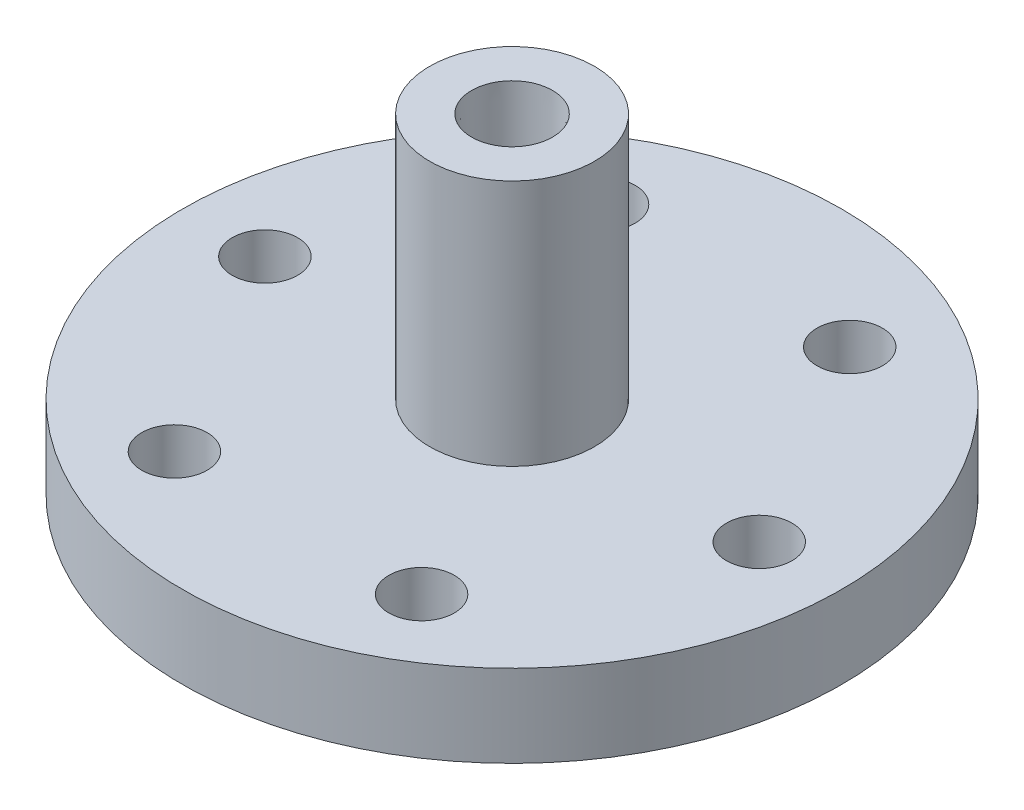
ISO-10303-21;
HEADER;
FILE_DESCRIPTION(('STEP AP214'),'2;1');
FILE_NAME('part.step','',(''),(''),'','','');
FILE_SCHEMA(('AUTOMOTIVE_DESIGN { 1 0 10303 214 1 1 1 1 }'));
ENDSEC;
DATA;
#1=APPLICATION_CONTEXT('core data for automotive mechanical design processes');
#2=APPLICATION_PROTOCOL_DEFINITION('international standard','automotive_design',2000,#1);
#3=PRODUCT_CONTEXT('',#1,'mechanical');
#4=PRODUCT('Part','Part','',(#3));
#5=PRODUCT_RELATED_PRODUCT_CATEGORY('part','',(#4));
#6=PRODUCT_DEFINITION_FORMATION('','',#4);
#7=PRODUCT_DEFINITION_CONTEXT('part definition',#1,'design');
#8=PRODUCT_DEFINITION('design','',#6,#7);
#9=PRODUCT_DEFINITION_SHAPE('','',#8);
#10=(LENGTH_UNIT() NAMED_UNIT(*) SI_UNIT(.MILLI.,.METRE.));
#11=(NAMED_UNIT(*) PLANE_ANGLE_UNIT() SI_UNIT($,.RADIAN.));
#12=(NAMED_UNIT(*) SI_UNIT($,.STERADIAN.) SOLID_ANGLE_UNIT());
#13=UNCERTAINTY_MEASURE_WITH_UNIT(LENGTH_MEASURE(1.E-05),#10,'distance_accuracy_value','');
#14=(GEOMETRIC_REPRESENTATION_CONTEXT(3) GLOBAL_UNCERTAINTY_ASSIGNED_CONTEXT((#13)) GLOBAL_UNIT_ASSIGNED_CONTEXT((#10,
#11,#12)) REPRESENTATION_CONTEXT('',''));
#15=CARTESIAN_POINT('',(0.,0.,0.));
#16=DIRECTION('',(0.,0.,1.));
#17=DIRECTION('',(1.,0.,0.));
#18=AXIS2_PLACEMENT_3D('',#15,#16,#17);
#19=CARTESIAN_POINT('',(0.,0.,0.));
#20=DIRECTION('',(0.,-1.,0.));
#21=DIRECTION('',(0.,0.,-1.));
#22=AXIS2_PLACEMENT_3D('',#19,#20,#21);
#23=PLANE('',#22);
#24=CARTESIAN_POINT('',(0.,0.,0.));
#25=DIRECTION('',(0.,1.,0.));
#26=DIRECTION('',(0.,0.,1.));
#27=AXIS2_PLACEMENT_3D('',#24,#25,#26);
#28=CIRCLE('',#27,6.2402847);
#29=CARTESIAN_POINT('',(0.,0.,6.2402847));
#30=VERTEX_POINT('',#29);
#31=EDGE_CURVE('E126',#30,#30,#28,.T.);
#32=ORIENTED_EDGE('',*,*,#31,.F.);
#33=EDGE_LOOP('',(#32));
#34=FACE_BOUND('',#33,.T.);
#35=CARTESIAN_POINT('',(0.,0.,0.));
#36=DIRECTION('',(0.,-1.,0.));
#37=DIRECTION('',(0.,0.,-1.));
#38=AXIS2_PLACEMENT_3D('',#35,#36,#37);
#39=CIRCLE('',#38,12.7);
#40=CARTESIAN_POINT('',(0.,0.,-12.7));
#41=VERTEX_POINT('',#40);
#42=EDGE_CURVE('E48',#41,#41,#39,.T.);
#43=ORIENTED_EDGE('',*,*,#42,.F.);
#44=EDGE_LOOP('',(#43));
#45=FACE_BOUND('',#44,.T.);
#46=ADVANCED_FACE('F41',(#34,#45),#23,.F.);
#47=CARTESIAN_POINT('',(0.,-50.8,0.));
#48=DIRECTION('',(0.,-1.,0.));
#49=DIRECTION('',(0.,0.,-1.));
#50=AXIS2_PLACEMENT_3D('',#47,#48,#49);
#51=CYLINDRICAL_SURFACE('',#50,12.7);
#52=CARTESIAN_POINT('',(0.,-38.1,0.));
#53=DIRECTION('',(0.,-1.,0.));
#54=DIRECTION('',(0.,0.,-1.));
#55=AXIS2_PLACEMENT_3D('',#52,#53,#54);
#56=CIRCLE('',#55,12.7);
#57=CARTESIAN_POINT('',(0.,-38.1,-12.7));
#58=VERTEX_POINT('',#57);
#59=EDGE_CURVE('E52',#58,#58,#56,.T.);
#60=ORIENTED_EDGE('',*,*,#59,.F.);
#61=EDGE_LOOP('',(#60));
#62=FACE_BOUND('',#61,.T.);
#63=ORIENTED_EDGE('',*,*,#42,.T.);
#64=EDGE_LOOP('',(#63));
#65=FACE_BOUND('',#64,.T.);
#66=ADVANCED_FACE('F160',(#62,#65),#51,.T.);
#67=CARTESIAN_POINT('',(-12.7,-38.1,0.));
#68=DIRECTION('',(0.,-1.,0.));
#69=DIRECTION('',(0.,0.,-1.));
#70=AXIS2_PLACEMENT_3D('',#67,#68,#69);
#71=PLANE('',#70);
#72=CARTESIAN_POINT('',(19.0500000000004,-38.1,-32.9955678841869));
#73=DIRECTION('',(0.,1.,0.));
#74=DIRECTION('',(0.,0.,1.));
#75=AXIS2_PLACEMENT_3D('',#72,#73,#74);
#76=CIRCLE('',#75,5.0419);
#77=CARTESIAN_POINT('',(19.0500000000004,-38.1,-27.9536678841869));
#78=VERTEX_POINT('',#77);
#79=EDGE_CURVE('E89',#78,#78,#76,.T.);
#80=ORIENTED_EDGE('',*,*,#79,.F.);
#81=EDGE_LOOP('',(#80));
#82=FACE_BOUND('',#81,.T.);
#83=CARTESIAN_POINT('',(-19.0499999999997,-38.1,-32.9955678841873));
#84=DIRECTION('',(0.,1.,0.));
#85=DIRECTION('',(0.,0.,1.));
#86=AXIS2_PLACEMENT_3D('',#83,#84,#85);
#87=CIRCLE('',#86,5.0419);
#88=CARTESIAN_POINT('',(-19.0499999999997,-38.1,-27.9536678841873));
#89=VERTEX_POINT('',#88);
#90=EDGE_CURVE('E96',#89,#89,#87,.T.);
#91=ORIENTED_EDGE('',*,*,#90,.F.);
#92=EDGE_LOOP('',(#91));
#93=FACE_BOUND('',#92,.T.);
#94=CARTESIAN_POINT('',(-38.1,-38.1,0.));
#95=DIRECTION('',(0.,1.,0.));
#96=DIRECTION('',(0.,0.,1.));
#97=AXIS2_PLACEMENT_3D('',#94,#95,#96);
#98=CIRCLE('',#97,5.04189999999999);
#99=CARTESIAN_POINT('',(-38.1,-38.1,5.04189999999999));
#100=VERTEX_POINT('',#99);
#101=EDGE_CURVE('E102',#100,#100,#98,.T.);
#102=ORIENTED_EDGE('',*,*,#101,.F.);
#103=EDGE_LOOP('',(#102));
#104=FACE_BOUND('',#103,.T.);
#105=CARTESIAN_POINT('',(-19.0500000000002,-38.1,32.995567884187));
#106=DIRECTION('',(0.,1.,0.));
#107=DIRECTION('',(0.,0.,1.));
#108=AXIS2_PLACEMENT_3D('',#105,#106,#107);
#109=CIRCLE('',#108,5.0419);
#110=CARTESIAN_POINT('',(-19.0500000000002,-38.1,38.037467884187));
#111=VERTEX_POINT('',#110);
#112=EDGE_CURVE('E108',#111,#111,#109,.T.);
#113=ORIENTED_EDGE('',*,*,#112,.F.);
#114=EDGE_LOOP('',(#113));
#115=FACE_BOUND('',#114,.T.);
#116=CARTESIAN_POINT('',(19.0499999999999,-38.1,32.9955678841872));
#117=DIRECTION('',(0.,1.,0.));
#118=DIRECTION('',(0.,0.,1.));
#119=AXIS2_PLACEMENT_3D('',#116,#117,#118);
#120=CIRCLE('',#119,5.0419);
#121=CARTESIAN_POINT('',(19.0499999999999,-38.1,38.0374678841872));
#122=VERTEX_POINT('',#121);
#123=EDGE_CURVE('E114',#122,#122,#120,.T.);
#124=ORIENTED_EDGE('',*,*,#123,.F.);
#125=EDGE_LOOP('',(#124));
#126=FACE_BOUND('',#125,.T.);
#127=CARTESIAN_POINT('',(38.1,-38.1,0.));
#128=DIRECTION('',(0.,1.,0.));
#129=DIRECTION('',(0.,0.,1.));
#130=AXIS2_PLACEMENT_3D('',#127,#128,#129);
#131=CIRCLE('',#130,5.04189999999999);
#132=CARTESIAN_POINT('',(38.1,-38.1,5.04189999999999));
#133=VERTEX_POINT('',#132);
#134=EDGE_CURVE('E120',#133,#133,#131,.T.);
#135=ORIENTED_EDGE('',*,*,#134,.F.);
#136=EDGE_LOOP('',(#135));
#137=FACE_BOUND('',#136,.T.);
#138=CARTESIAN_POINT('',(0.,-38.1,0.));
#139=DIRECTION('',(0.,-1.,0.));
#140=DIRECTION('',(0.,0.,-1.));
#141=AXIS2_PLACEMENT_3D('',#138,#139,#140);
#142=CIRCLE('',#141,50.8);
#143=CARTESIAN_POINT('',(0.,-38.1,-50.8));
#144=VERTEX_POINT('',#143);
#145=EDGE_CURVE('E153',#144,#144,#142,.T.);
#146=ORIENTED_EDGE('',*,*,#145,.F.);
#147=EDGE_LOOP('',(#146));
#148=FACE_BOUND('',#147,.T.);
#149=ORIENTED_EDGE('',*,*,#59,.T.);
#150=EDGE_LOOP('',(#149));
#151=FACE_BOUND('',#150,.T.);
#152=ADVANCED_FACE('F158',(#82,#93,#104,#115,#126,#137,#148,#151),#71,.F.);
#153=CARTESIAN_POINT('',(0.,-50.8,0.));
#154=DIRECTION('',(0.,-1.,0.));
#155=DIRECTION('',(0.,0.,-1.));
#156=AXIS2_PLACEMENT_3D('',#153,#154,#155);
#157=CYLINDRICAL_SURFACE('',#156,50.8);
#158=CARTESIAN_POINT('',(-42.3205804778574,-44.45,28.0999727405062));
#159=CARTESIAN_POINT('',(-42.3205855480495,-44.6281541798841,28.0999666159225));
#160=CARTESIAN_POINT('',(-42.3289250034515,-44.8064331036932,28.0874178109304));
#161=CARTESIAN_POINT('',(-42.3620053783552,-45.1580682257698,28.0374992160744));
#162=CARTESIAN_POINT('',(-42.3867653884447,-45.3314184489873,28.0001005355712));
#163=CARTESIAN_POINT('',(-42.4517712479669,-45.6680517901773,27.9014441784418));
#164=CARTESIAN_POINT('',(-42.4920089230574,-45.8313401694661,27.840199095797));
#165=CARTESIAN_POINT('',(-42.5865065637453,-46.1432764884545,27.6954309319838));
#166=CARTESIAN_POINT('',(-42.6407633184384,-46.2919277698549,27.6119129520185));
#167=CARTESIAN_POINT('',(-42.7614669531664,-46.5706363624414,27.4246118706816));
#168=CARTESIAN_POINT('',(-42.8279298970089,-46.7006687643772,27.3208020527604));
#169=CARTESIAN_POINT('',(-42.9707099663769,-46.9382352974481,27.0956788847245));
#170=CARTESIAN_POINT('',(-43.0470275027092,-47.0457684901723,26.9743648048876));
#171=CARTESIAN_POINT('',(-43.2070275983946,-47.2353601033654,26.7173289528471));
#172=CARTESIAN_POINT('',(-43.2907160186448,-47.3173980124403,26.5815956973527));
#173=CARTESIAN_POINT('',(-43.4626955871,-47.4535389486926,26.2994554908669));
#174=CARTESIAN_POINT('',(-43.5509866860275,-47.5076422748771,26.1530486541431));
#175=CARTESIAN_POINT('',(-43.7293046101747,-47.5863094055372,25.8537850443779));
#176=CARTESIAN_POINT('',(-43.8193289921892,-47.6109120811561,25.7009370341297));
#177=CARTESIAN_POINT('',(-43.9985521529892,-47.6299995688616,25.3928957754334));
#178=CARTESIAN_POINT('',(-44.0877509410692,-47.6244847204229,25.2377025534394));
#179=CARTESIAN_POINT('',(-44.262686296587,-47.5835257767703,24.9296198780836));
#180=CARTESIAN_POINT('',(-44.3484275259916,-47.5481234971942,24.7767275096259));
#181=CARTESIAN_POINT('',(-44.514309506493,-47.4484595213891,24.4774496441903));
#182=CARTESIAN_POINT('',(-44.5944502244799,-47.3841976545606,24.3310641856827));
#183=CARTESIAN_POINT('',(-44.747195847757,-47.2285913146413,24.0489965538199));
#184=CARTESIAN_POINT('',(-44.8197954320322,-47.1372278916479,23.913321954017));
#185=CARTESIAN_POINT('',(-44.9557094040366,-46.9300257017768,23.6568234256756));
#186=CARTESIAN_POINT('',(-45.0190236872644,-46.8141866594741,23.5359996642783));
#187=CARTESIAN_POINT('',(-45.1350887600129,-46.5610853101927,23.3126503591735));
#188=CARTESIAN_POINT('',(-45.187821300988,-46.42378670848,23.2101564584309));
#189=CARTESIAN_POINT('',(-45.2815010255034,-46.1317908061805,23.0268602902374));
#190=CARTESIAN_POINT('',(-45.3224482043537,-45.9770934986701,22.9460580314186));
#191=CARTESIAN_POINT('',(-45.3917552221831,-45.6546682606461,22.8086498869186));
#192=CARTESIAN_POINT('',(-45.4201143504167,-45.4869395949853,22.7520453674948));
#193=CARTESIAN_POINT('',(-45.4637032363785,-45.1432234921541,22.6648204523468));
#194=CARTESIAN_POINT('',(-45.4789331485583,-44.967236152164,22.6341997509502));
#195=CARTESIAN_POINT('',(-45.4959666144394,-44.6123169668342,22.5999423663379));
#196=CARTESIAN_POINT('',(-45.4977928305485,-44.4333906044109,22.5962601367171));
#197=CARTESIAN_POINT('',(-45.4880452462326,-44.0773923558426,22.6158761711177));
#198=CARTESIAN_POINT('',(-45.4764715155328,-43.900320460053,22.6391742947499));
#199=CARTESIAN_POINT('',(-45.4401524615211,-43.5532011576711,22.7119831838036));
#200=CARTESIAN_POINT('',(-45.4154176554068,-43.3831482588607,22.7614730188968));
#201=CARTESIAN_POINT('',(-45.3532467417813,-43.0547246131067,22.8850992904343));
#202=CARTESIAN_POINT('',(-45.3158105190832,-42.8963539721234,22.9592359503961));
#203=CARTESIAN_POINT('',(-45.2289018612881,-42.5955571738718,23.129971678712));
#204=CARTESIAN_POINT('',(-45.1794133460828,-42.4531526923707,23.2266007486484));
#205=CARTESIAN_POINT('',(-45.0694280419598,-42.1885489099404,23.4393035942448));
#206=CARTESIAN_POINT('',(-45.0089311452465,-42.0663498068871,23.5553775603107));
#207=CARTESIAN_POINT('',(-44.878132939969,-41.8454540614888,23.8036311927636));
#208=CARTESIAN_POINT('',(-44.8078181391438,-41.7467902766914,23.9358329907113));
#209=CARTESIAN_POINT('',(-44.6590574812918,-41.5759907178595,24.212252814736));
#210=CARTESIAN_POINT('',(-44.5806116744204,-41.5038547802029,24.3564707666913));
#211=CARTESIAN_POINT('',(-44.4175690151356,-41.3882157401491,24.6525471177624));
#212=CARTESIAN_POINT('',(-44.3329766798851,-41.3446918420854,24.8043998811731));
#213=CARTESIAN_POINT('',(-44.1598016670401,-41.287444308176,25.1114110452616));
#214=CARTESIAN_POINT('',(-44.0712190287134,-41.2737203791394,25.2665694134015));
#215=CARTESIAN_POINT('',(-43.892677517163,-41.2764652063751,25.5754693395137));
#216=CARTESIAN_POINT('',(-43.8027212470527,-41.292882539805,25.729212861633));
#217=CARTESIAN_POINT('',(-43.6239146739769,-41.3553372479883,26.0312289016783));
#218=CARTESIAN_POINT('',(-43.535064372956,-41.4013746748156,26.1795014099853));
#219=CARTESIAN_POINT('',(-43.3611924596273,-41.5217511472817,26.4664913006225));
#220=CARTESIAN_POINT('',(-43.2761708201034,-41.5960899917047,26.6052087508784));
#221=CARTESIAN_POINT('',(-43.1126685087877,-41.7709519088447,26.8693500544239));
#222=CARTESIAN_POINT('',(-43.0341876674001,-41.8714743023718,26.9947742524159));
#223=CARTESIAN_POINT('',(-42.8862378350475,-42.0960397491127,27.2292101239054));
#224=CARTESIAN_POINT('',(-42.8167833723799,-42.2201199486695,27.3381953825022));
#225=CARTESIAN_POINT('',(-42.6893917094876,-42.4882294857083,27.53669890343));
#226=CARTESIAN_POINT('',(-42.6314573321009,-42.6322636980121,27.6262123949768));
#227=CARTESIAN_POINT('',(-42.5291023346257,-42.9363573236669,27.7835257142831));
#228=CARTESIAN_POINT('',(-42.4846985774068,-43.0964364059935,27.8512984525919));
#229=CARTESIAN_POINT('',(-42.4111459537588,-43.4278167116831,27.9631762067849));
#230=CARTESIAN_POINT('',(-42.3819792209422,-43.5991045255745,28.0073089436331));
#231=CARTESIAN_POINT('',(-42.3475498535238,-43.8845335523526,28.0593223212511));
#232=CARTESIAN_POINT('',(-42.3374525416107,-43.9968297497903,28.0745483206204));
#233=CARTESIAN_POINT('',(-42.3239662411091,-44.2227337084224,28.0948754768783));
#234=CARTESIAN_POINT('',(-42.320577243184,-44.3363414677911,28.0999766478588));
#235=CARTESIAN_POINT('',(-42.3205804778574,-44.45,28.0999727405062));
#236=B_SPLINE_CURVE_WITH_KNOTS('',3,(#158,#159,#160,#161,#162,#163,#164,#165,#166,#167,#168,
#169,#170,#171,#172,#173,#174,#175,#176,#177,#178,#179,#180,#181,#182,#183,#184,#185,#186,#187,
#188,#189,#190,#191,#192,#193,#194,#195,#196,#197,#198,#199,#200,#201,#202,#203,#204,#205,#206,
#207,#208,#209,#210,#211,#212,#213,#214,#215,#216,#217,#218,#219,#220,#221,#222,#223,#224,#225,
#226,#227,#228,#229,#230,#231,#232,#233,#234,#235),.UNSPECIFIED.,.T.,.F.,(4,2,2,2,2,2,2,2,2,2,2,
2,2,2,2,2,2,2,2,2,2,2,2,2,2,2,2,2,2,2,2,2,2,2,2,2,2,2,4),(0.,0.534047615023741,1.06871720646607,
1.6031048054631,2.13737011763189,2.67234364826976,3.20733948746788,3.74276463239661,
4.27818404610366,4.81289719350487,5.3476043138126,5.88156456045961,6.41552796357882,
6.94986560726929,7.48420926420131,8.01946664056017,8.55472422992342,9.09001203711487,
9.62529354712123,10.1596698166503,10.6940433056275,11.2279904092672,11.7619423553075,
12.2966106381626,12.8312841568348,13.3666998182805,13.9021121772589,14.4371349588589,
14.9721524765425,15.5062580695995,16.0403646016478,16.5744673364058,17.1085562181489,
17.6434943616362,18.1785634232433,18.7142966259533,19.2494002291418,19.5901115869918,
19.9308224706364),.UNSPECIFIED.);
#237=CARTESIAN_POINT('',(-42.3205804778574,-44.45,28.0999727405062));
#238=VERTEX_POINT('',#237);
#239=EDGE_CURVE('E10',#238,#238,#236,.T.);
#240=ORIENTED_EDGE('',*,*,#239,.T.);
#241=EDGE_LOOP('',(#240));
#242=FACE_BOUND('',#241,.T.);
#243=CARTESIAN_POINT('',(0.,-50.8,0.));
#244=DIRECTION('',(0.,-1.,0.));
#245=DIRECTION('',(0.,0.,-1.));
#246=AXIS2_PLACEMENT_3D('',#243,#244,#245);
#247=CIRCLE('',#246,50.8);
#248=CARTESIAN_POINT('',(0.,-50.8,-50.8));
#249=VERTEX_POINT('',#248);
#250=EDGE_CURVE('E150',#249,#249,#247,.T.);
#251=ORIENTED_EDGE('',*,*,#250,.F.);
#252=EDGE_LOOP('',(#251));
#253=FACE_BOUND('',#252,.T.);
#254=ORIENTED_EDGE('',*,*,#145,.T.);
#255=EDGE_LOOP('',(#254));
#256=FACE_BOUND('',#255,.T.);
#257=ADVANCED_FACE('F60',(#242,#253,#256),#157,.T.);
#258=CARTESIAN_POINT('',(-50.8,-50.8,0.));
#259=DIRECTION('',(0.,1.,0.));
#260=DIRECTION('',(0.,0.,1.));
#261=AXIS2_PLACEMENT_3D('',#258,#259,#260);
#262=PLANE('',#261);
#263=CARTESIAN_POINT('',(19.0500000000004,-50.8,-32.9955678841869));
#264=DIRECTION('',(0.,1.,0.));
#265=DIRECTION('',(0.,0.,1.));
#266=AXIS2_PLACEMENT_3D('',#263,#264,#265);
#267=CIRCLE('',#266,5.04189999999999);
#268=CARTESIAN_POINT('',(19.0500000000004,-50.8,-27.9536678841869));
#269=VERTEX_POINT('',#268);
#270=EDGE_CURVE('E93',#269,#269,#267,.T.);
#271=ORIENTED_EDGE('',*,*,#270,.T.);
#272=EDGE_LOOP('',(#271));
#273=FACE_BOUND('',#272,.T.);
#274=CARTESIAN_POINT('',(-19.0499999999997,-50.8,-32.9955678841873));
#275=DIRECTION('',(0.,1.,0.));
#276=DIRECTION('',(0.,0.,1.));
#277=AXIS2_PLACEMENT_3D('',#274,#275,#276);
#278=CIRCLE('',#277,5.0419);
#279=CARTESIAN_POINT('',(-19.0499999999997,-50.8,-27.9536678841873));
#280=VERTEX_POINT('',#279);
#281=EDGE_CURVE('E99',#280,#280,#278,.T.);
#282=ORIENTED_EDGE('',*,*,#281,.T.);
#283=EDGE_LOOP('',(#282));
#284=FACE_BOUND('',#283,.T.);
#285=CARTESIAN_POINT('',(-38.1,-50.8,0.));
#286=DIRECTION('',(0.,1.,0.));
#287=DIRECTION('',(0.,0.,1.));
#288=AXIS2_PLACEMENT_3D('',#285,#286,#287);
#289=CIRCLE('',#288,5.04189999999999);
#290=CARTESIAN_POINT('',(-38.1,-50.8,5.04189999999999));
#291=VERTEX_POINT('',#290);
#292=EDGE_CURVE('E105',#291,#291,#289,.T.);
#293=ORIENTED_EDGE('',*,*,#292,.T.);
#294=EDGE_LOOP('',(#293));
#295=FACE_BOUND('',#294,.T.);
#296=CARTESIAN_POINT('',(-19.0500000000002,-50.8,32.995567884187));
#297=DIRECTION('',(0.,1.,0.));
#298=DIRECTION('',(0.,0.,1.));
#299=AXIS2_PLACEMENT_3D('',#296,#297,#298);
#300=CIRCLE('',#299,5.0419);
#301=CARTESIAN_POINT('',(-19.0500000000002,-50.8,38.037467884187));
#302=VERTEX_POINT('',#301);
#303=EDGE_CURVE('E111',#302,#302,#300,.T.);
#304=ORIENTED_EDGE('',*,*,#303,.T.);
#305=EDGE_LOOP('',(#304));
#306=FACE_BOUND('',#305,.T.);
#307=CARTESIAN_POINT('',(19.0499999999999,-50.8,32.9955678841872));
#308=DIRECTION('',(0.,1.,0.));
#309=DIRECTION('',(0.,0.,1.));
#310=AXIS2_PLACEMENT_3D('',#307,#308,#309);
#311=CIRCLE('',#310,5.0419);
#312=CARTESIAN_POINT('',(19.0499999999999,-50.8,38.0374678841872));
#313=VERTEX_POINT('',#312);
#314=EDGE_CURVE('E117',#313,#313,#311,.T.);
#315=ORIENTED_EDGE('',*,*,#314,.T.);
#316=EDGE_LOOP('',(#315));
#317=FACE_BOUND('',#316,.T.);
#318=CARTESIAN_POINT('',(38.1,-50.8,0.));
#319=DIRECTION('',(0.,1.,0.));
#320=DIRECTION('',(0.,0.,1.));
#321=AXIS2_PLACEMENT_3D('',#318,#319,#320);
#322=CIRCLE('',#321,5.04189999999999);
#323=CARTESIAN_POINT('',(38.1,-50.8,5.04189999999999));
#324=VERTEX_POINT('',#323);
#325=EDGE_CURVE('E123',#324,#324,#322,.T.);
#326=ORIENTED_EDGE('',*,*,#325,.T.);
#327=EDGE_LOOP('',(#326));
#328=FACE_BOUND('',#327,.T.);
#329=CARTESIAN_POINT('',(0.,-50.8,0.));
#330=DIRECTION('',(0.,-1.,0.));
#331=DIRECTION('',(0.,0.,-1.));
#332=AXIS2_PLACEMENT_3D('',#329,#330,#331);
#333=CIRCLE('',#332,13.081);
#334=CARTESIAN_POINT('',(0.,-50.8,-13.081));
#335=VERTEX_POINT('',#334);
#336=EDGE_CURVE('E147',#335,#335,#333,.T.);
#337=ORIENTED_EDGE('',*,*,#336,.F.);
#338=EDGE_LOOP('',(#337));
#339=FACE_BOUND('',#338,.T.);
#340=ORIENTED_EDGE('',*,*,#250,.T.);
#341=EDGE_LOOP('',(#340));
#342=FACE_BOUND('',#341,.T.);
#343=ADVANCED_FACE('F207',(#273,#284,#295,#306,#317,#328,#339,#342),#262,.F.);
#344=CARTESIAN_POINT('',(0.,-50.8,0.));
#345=DIRECTION('',(0.,-1.,0.));
#346=DIRECTION('',(0.,0.,-1.));
#347=AXIS2_PLACEMENT_3D('',#344,#345,#346);
#348=CYLINDRICAL_SURFACE('',#347,13.081);
#349=CARTESIAN_POINT('',(0.,-48.26,0.));
#350=DIRECTION('',(0.,-1.,0.));
#351=DIRECTION('',(0.,0.,-1.));
#352=AXIS2_PLACEMENT_3D('',#349,#350,#351);
#353=CIRCLE('',#352,13.081);
#354=CARTESIAN_POINT('',(0.,-48.26,-13.081));
#355=VERTEX_POINT('',#354);
#356=EDGE_CURVE('E144',#355,#355,#353,.T.);
#357=ORIENTED_EDGE('',*,*,#356,.F.);
#358=EDGE_LOOP('',(#357));
#359=FACE_BOUND('',#358,.T.);
#360=ORIENTED_EDGE('',*,*,#336,.T.);
#361=EDGE_LOOP('',(#360));
#362=FACE_BOUND('',#361,.T.);
#363=ADVANCED_FACE('F204',(#359,#362),#348,.F.);
#364=CARTESIAN_POINT('',(-9.525,-48.26,0.));
#365=DIRECTION('',(0.,1.,0.));
#366=DIRECTION('',(0.,0.,1.));
#367=AXIS2_PLACEMENT_3D('',#364,#365,#366);
#368=PLANE('',#367);
#369=CARTESIAN_POINT('',(0.,-48.26,0.));
#370=DIRECTION('',(0.,-1.,0.));
#371=DIRECTION('',(0.,0.,-1.));
#372=AXIS2_PLACEMENT_3D('',#369,#370,#371);
#373=CIRCLE('',#372,9.525);
#374=CARTESIAN_POINT('',(0.,-48.26,-9.525));
#375=VERTEX_POINT('',#374);
#376=EDGE_CURVE('E141',#375,#375,#373,.T.);
#377=ORIENTED_EDGE('',*,*,#376,.F.);
#378=EDGE_LOOP('',(#377));
#379=FACE_BOUND('',#378,.T.);
#380=ORIENTED_EDGE('',*,*,#356,.T.);
#381=EDGE_LOOP('',(#380));
#382=FACE_BOUND('',#381,.T.);
#383=ADVANCED_FACE('F200',(#379,#382),#368,.F.);
#384=CARTESIAN_POINT('',(0.,-50.8,0.));
#385=DIRECTION('',(0.,-1.,0.));
#386=DIRECTION('',(0.,0.,-1.));
#387=AXIS2_PLACEMENT_3D('',#384,#385,#386);
#388=CYLINDRICAL_SURFACE('',#387,9.525);
#389=CARTESIAN_POINT('',(0.,-50.8,0.));
#390=DIRECTION('',(0.,-1.,0.));
#391=DIRECTION('',(0.,0.,-1.));
#392=AXIS2_PLACEMENT_3D('',#389,#390,#391);
#393=CIRCLE('',#392,9.525);
#394=CARTESIAN_POINT('',(0.,-50.8,-9.525));
#395=VERTEX_POINT('',#394);
#396=EDGE_CURVE('E138',#395,#395,#393,.T.);
#397=ORIENTED_EDGE('',*,*,#396,.F.);
#398=EDGE_LOOP('',(#397));
#399=FACE_BOUND('',#398,.T.);
#400=ORIENTED_EDGE('',*,*,#376,.T.);
#401=EDGE_LOOP('',(#400));
#402=FACE_BOUND('',#401,.T.);
#403=ADVANCED_FACE('F196',(#399,#402),#388,.T.);
#404=CARTESIAN_POINT('',(0.,-50.8,0.));
#405=DIRECTION('',(0.,1.,0.));
#406=DIRECTION('',(0.,0.,1.));
#407=AXIS2_PLACEMENT_3D('',#404,#405,#406);
#408=PLANE('',#407);
#409=CARTESIAN_POINT('',(0.,-50.8,0.));
#410=DIRECTION('',(0.,1.,0.));
#411=DIRECTION('',(0.,0.,1.));
#412=AXIS2_PLACEMENT_3D('',#409,#410,#411);
#413=CIRCLE('',#412,5.5626);
#414=CARTESIAN_POINT('',(0.,-50.8,5.5626));
#415=VERTEX_POINT('',#414);
#416=EDGE_CURVE('E135',#415,#415,#413,.T.);
#417=ORIENTED_EDGE('',*,*,#416,.T.);
#418=EDGE_LOOP('',(#417));
#419=FACE_BOUND('',#418,.T.);
#420=ORIENTED_EDGE('',*,*,#396,.T.);
#421=EDGE_LOOP('',(#420));
#422=FACE_BOUND('',#421,.T.);
#423=ADVANCED_FACE('F192',(#419,#422),#408,.F.);
#424=CARTESIAN_POINT('',(0.,0.,0.));
#425=DIRECTION('',(0.,1.,0.));
#426=DIRECTION('',(0.,0.,1.));
#427=AXIS2_PLACEMENT_3D('',#424,#425,#426);
#428=CYLINDRICAL_SURFACE('',#427,5.5626);
#429=CARTESIAN_POINT('',(-4.6066386435987,-44.45,3.11791583711029));
#430=CARTESIAN_POINT('',(-4.60663929570608,-44.4277378170183,3.11791508552898));
#431=CARTESIAN_POINT('',(-4.60769565131616,-44.4054602143666,3.11635589957422));
#432=CARTESIAN_POINT('',(-4.61188468599652,-44.361520636635,3.11015302978328));
#433=CARTESIAN_POINT('',(-4.6150197568294,-44.3398594007215,3.10550579283282));
#434=CARTESIAN_POINT('',(-4.62324669244346,-44.2977953565177,3.09324473066561));
#435=CARTESIAN_POINT('',(-4.62833749451552,-44.2773918717632,3.08563251653293));
#436=CARTESIAN_POINT('',(-4.64028564491051,-44.2384134639076,3.06763491952184));
#437=CARTESIAN_POINT('',(-4.6471425992006,-44.2198381342167,3.05725015518725));
#438=CARTESIAN_POINT('',(-4.66238831943703,-44.1850025510213,3.03394916132968));
#439=CARTESIAN_POINT('',(-4.67077966366324,-44.1687462773965,3.02102866822867));
#440=CARTESIAN_POINT('',(-4.68879105077946,-44.1390443837969,2.99299752740373));
#441=CARTESIAN_POINT('',(-4.69841114582837,-44.1255988831997,2.97788678670293));
#442=CARTESIAN_POINT('',(-4.71856263777844,-44.1018875037404,2.94585188056685));
#443=CARTESIAN_POINT('',(-4.72909498334684,-44.091624986968,2.92892582288365));
#444=CARTESIAN_POINT('',(-4.75071562688542,-44.0745924048538,2.89372527728014));
#445=CARTESIAN_POINT('',(-4.7618039174315,-44.0678222928882,2.87545080736497));
#446=CARTESIAN_POINT('',(-4.78416763837792,-44.0579779317373,2.83808593426369));
#447=CARTESIAN_POINT('',(-4.79544271453235,-44.0548973528419,2.81899698683632));
#448=CARTESIAN_POINT('',(-4.81786139246092,-44.0524999488491,2.780508275816));
#449=CARTESIAN_POINT('',(-4.82900499609061,-44.053183070568,2.76110851661888));
#450=CARTESIAN_POINT('',(-4.85082685450329,-44.0582884736584,2.72258826431893));
#451=CARTESIAN_POINT('',(-4.86150591933012,-44.0627039473114,2.70346732720124));
#452=CARTESIAN_POINT('',(-4.88214047442933,-44.0751381424723,2.66602333704637));
#453=CARTESIAN_POINT('',(-4.89209595939473,-44.0831568904049,2.64770028986158));
#454=CARTESIAN_POINT('',(-4.91105027976431,-44.1025776729256,2.61237564636271));
#455=CARTESIAN_POINT('',(-4.92004823670735,-44.1139827785098,2.59537526727789));
#456=CARTESIAN_POINT('',(-4.93687547124974,-44.1398502954391,2.56322241579095));
#457=CARTESIAN_POINT('',(-4.94470473157645,-44.1543127519626,2.54806997070082));
#458=CARTESIAN_POINT('',(-4.95904835936925,-44.185922852276,2.5200410933388));
#459=CARTESIAN_POINT('',(-4.96555975808083,-44.2030764074715,2.50716980777628));
#460=CARTESIAN_POINT('',(-4.97711963139266,-44.2395611112667,2.48414280501616));
#461=CARTESIAN_POINT('',(-4.98216810520129,-44.2588922610447,2.47398708928802));
#462=CARTESIAN_POINT('',(-4.99071034719858,-44.2991873447993,2.4567096580019));
#463=CARTESIAN_POINT('',(-4.99420399078752,-44.320151409475,2.44958818560163));
#464=CARTESIAN_POINT('',(-4.99957479931896,-44.3631153984922,2.43860785539029));
#465=CARTESIAN_POINT('',(-5.00145198908672,-44.38511530692,2.43474894747329));
#466=CARTESIAN_POINT('',(-5.00355565901232,-44.4294745960399,2.43042288926309));
#467=CARTESIAN_POINT('',(-5.00378576699155,-44.4518330779281,2.42994828479602));
#468=CARTESIAN_POINT('',(-5.00260100893452,-44.4963204434958,2.43238641485307));
#469=CARTESIAN_POINT('',(-5.00118615409448,-44.5184493287369,2.43529912632188));
#470=CARTESIAN_POINT('',(-4.99673774162751,-44.561825820692,2.44441324388692));
#471=CARTESIAN_POINT('',(-4.99370587827622,-44.5830743247875,2.45061120770656));
#472=CARTESIAN_POINT('',(-4.98607671535406,-44.6241146250713,2.46609647371004));
#473=CARTESIAN_POINT('',(-4.98147939730075,-44.6439064040575,2.47538381236837));
#474=CARTESIAN_POINT('',(-4.9707921815173,-44.6815093678244,2.4967752216928));
#475=CARTESIAN_POINT('',(-4.96469969245657,-44.6993170351216,2.50888418074316));
#476=CARTESIAN_POINT('',(-4.95114167844434,-44.7324108019965,2.53553500757731));
#477=CARTESIAN_POINT('',(-4.94367613609529,-44.747696869619,2.55007690618792));
#478=CARTESIAN_POINT('',(-4.92750879559767,-44.775341569357,2.58117860130674));
#479=CARTESIAN_POINT('',(-4.91880477986148,-44.7876948418263,2.59774200975689));
#480=CARTESIAN_POINT('',(-4.90036246045078,-44.8090865740999,2.63236599552893));
#481=CARTESIAN_POINT('',(-4.89062416471484,-44.8181250593443,2.65042656135921));
#482=CARTESIAN_POINT('',(-4.87035545426765,-44.8326213705457,2.68748987849824));
#483=CARTESIAN_POINT('',(-4.85982579362213,-44.8380825581579,2.70649172714743));
#484=CARTESIAN_POINT('',(-4.83823805974118,-44.8452802468643,2.74489640213814));
#485=CARTESIAN_POINT('',(-4.82717999357657,-44.8470167977853,2.7642992231121));
#486=CARTESIAN_POINT('',(-4.80486672064389,-44.8467154019417,2.80290394700746));
#487=CARTESIAN_POINT('',(-4.79361200621419,-44.8446858288742,2.82210620042952));
#488=CARTESIAN_POINT('',(-4.77121180419471,-44.836927198649,2.85981429495379));
#489=CARTESIAN_POINT('',(-4.76006631678222,-44.8311981354874,2.87832013492576));
#490=CARTESIAN_POINT('',(-4.73822949696639,-44.8162051443764,2.91412767878025));
#491=CARTESIAN_POINT('',(-4.72753815376865,-44.8069413004961,2.93142941128903));
#492=CARTESIAN_POINT('',(-4.70695504357991,-44.7851427701476,2.96436681563504));
#493=CARTESIAN_POINT('',(-4.69706325903076,-44.7726081555303,2.98000252406023));
#494=CARTESIAN_POINT('',(-4.67839146459451,-44.7445926512532,3.00923146443641));
#495=CARTESIAN_POINT('',(-4.66961383289941,-44.7291056300885,3.02282033852133));
#496=CARTESIAN_POINT('',(-4.65349916023068,-44.6956346761697,3.04757002435385));
#497=CARTESIAN_POINT('',(-4.64616247084679,-44.677650135844,3.05873024358156));
#498=CARTESIAN_POINT('',(-4.63318718751449,-44.6396685856243,3.07834927028717));
#499=CARTESIAN_POINT('',(-4.62755112932421,-44.6196686292566,3.08680404488507));
#500=CARTESIAN_POINT('',(-4.6182061706944,-44.5782595855013,3.10076793382284));
#501=CARTESIAN_POINT('',(-4.61449502935908,-44.5568521694866,3.10628047358926));
#502=CARTESIAN_POINT('',(-4.61009682121488,-44.5210963018962,3.11280176784475));
#503=CARTESIAN_POINT('',(-4.60880215632136,-44.5069785462711,3.11471730066088));
#504=CARTESIAN_POINT('',(-4.60707285900932,-44.4785759783572,3.1172745753386));
#505=CARTESIAN_POINT('',(-4.6066382249796,-44.4642911663814,3.1179163195865));
#506=CARTESIAN_POINT('',(-4.6066386435987,-44.45,3.11791583711029));
#507=B_SPLINE_CURVE_WITH_KNOTS('',3,(#429,#430,#431,#432,#433,#434,#435,#436,#437,#438,#439,
#440,#441,#442,#443,#444,#445,#446,#447,#448,#449,#450,#451,#452,#453,#454,#455,#456,#457,#458,
#459,#460,#461,#462,#463,#464,#465,#466,#467,#468,#469,#470,#471,#472,#473,#474,#475,#476,#477,
#478,#479,#480,#481,#482,#483,#484,#485,#486,#487,#488,#489,#490,#491,#492,#493,#494,#495,#496,
#497,#498,#499,#500,#501,#502,#503,#504,#505,#506),.UNSPECIFIED.,.T.,.F.,(4,2,2,2,2,2,2,2,2,2,2,
2,2,2,2,2,2,2,2,2,2,2,2,2,2,2,2,2,2,2,2,2,2,2,2,2,2,2,4),(0.,0.066734374225303,
0.133545666346583,0.200320705647738,0.267080860159962,0.333954242140061,0.400830463753437,
0.467777086006036,0.534722814492712,0.601553526573507,0.668383294296537,0.735091428536436,
0.801800051988097,0.868569357422467,0.935339649569895,1.00225872120837,1.06917782905807,
1.1361022986523,1.20302574041292,1.26980173277863,1.33657727064556,1.403282979233,
1.46998947540497,1.53681240956137,1.60363619046908,1.67058116681885,1.737525629372,
1.80440709233546,1.87128766057872,1.93801970299315,2.00475185370538,2.07148241739589,
2.13821151529809,2.20508073518941,2.27196625094649,2.33895101031223,2.4058576132189,
2.44869769915726,2.49153770483849),.UNSPECIFIED.);
#508=CARTESIAN_POINT('',(-4.6066386435987,-44.45,3.11791583711029));
#509=VERTEX_POINT('',#508);
#510=EDGE_CURVE('E82',#509,#509,#507,.T.);
#511=ORIENTED_EDGE('',*,*,#510,.T.);
#512=EDGE_LOOP('',(#511));
#513=FACE_BOUND('',#512,.T.);
#514=ORIENTED_EDGE('',*,*,#416,.F.);
#515=EDGE_LOOP('',(#514));
#516=FACE_BOUND('',#515,.T.);
#517=CARTESIAN_POINT('',(0.,-9.906,0.));
#518=DIRECTION('',(0.,1.,0.));
#519=DIRECTION('',(0.,0.,1.));
#520=AXIS2_PLACEMENT_3D('',#517,#518,#519);
#521=CIRCLE('',#520,5.56260000000001);
#522=CARTESIAN_POINT('',(0.,-9.906,5.56260000000001));
#523=VERTEX_POINT('',#522);
#524=EDGE_CURVE('E132',#523,#523,#521,.T.);
#525=ORIENTED_EDGE('',*,*,#524,.T.);
#526=EDGE_LOOP('',(#525));
#527=FACE_BOUND('',#526,.T.);
#528=ADVANCED_FACE('F184',(#513,#516,#527),#428,.F.);
#529=CARTESIAN_POINT('',(5.56260000000001,-9.906,0.));
#530=DIRECTION('',(0.,-1.,0.));
#531=DIRECTION('',(0.,0.,-1.));
#532=AXIS2_PLACEMENT_3D('',#529,#530,#531);
#533=PLANE('',#532);
#534=ORIENTED_EDGE('',*,*,#524,.F.);
#535=EDGE_LOOP('',(#534));
#536=FACE_BOUND('',#535,.T.);
#537=CARTESIAN_POINT('',(0.,-9.906,0.));
#538=DIRECTION('',(0.,1.,0.));
#539=DIRECTION('',(0.,0.,1.));
#540=AXIS2_PLACEMENT_3D('',#537,#538,#539);
#541=CIRCLE('',#540,5.94368579417672);
#542=CARTESIAN_POINT('',(0.,-9.906,5.94368579417672));
#543=VERTEX_POINT('',#542);
#544=EDGE_CURVE('E129',#543,#543,#541,.T.);
#545=ORIENTED_EDGE('',*,*,#544,.T.);
#546=EDGE_LOOP('',(#545));
#547=FACE_BOUND('',#546,.T.);
#548=ADVANCED_FACE('F174',(#536,#547),#533,.F.);
#549=CARTESIAN_POINT('',(0.,0.,0.));
#550=DIRECTION('',(0.,1.,0.));
#551=DIRECTION('',(0.,0.,1.));
#552=AXIS2_PLACEMENT_3D('',#549,#550,#551);
#553=CONICAL_SURFACE('',#552,6.2402847,0.0299323966717028);
#554=ORIENTED_EDGE('',*,*,#544,.F.);
#555=EDGE_LOOP('',(#554));
#556=FACE_BOUND('',#555,.T.);
#557=ORIENTED_EDGE('',*,*,#31,.T.);
#558=EDGE_LOOP('',(#557));
#559=FACE_BOUND('',#558,.T.);
#560=ADVANCED_FACE('F171',(#556,#559),#553,.F.);
#561=CARTESIAN_POINT('',(38.1,-38.1,0.));
#562=DIRECTION('',(0.,1.,0.));
#563=DIRECTION('',(0.,0.,1.));
#564=AXIS2_PLACEMENT_3D('',#561,#562,#563);
#565=CYLINDRICAL_SURFACE('',#564,5.04189999999999);
#566=ORIENTED_EDGE('',*,*,#325,.F.);
#567=EDGE_LOOP('',(#566));
#568=FACE_BOUND('',#567,.T.);
#569=ORIENTED_EDGE('',*,*,#134,.T.);
#570=EDGE_LOOP('',(#569));
#571=FACE_BOUND('',#570,.T.);
#572=ADVANCED_FACE('F173',(#568,#571),#565,.F.);
#573=CARTESIAN_POINT('',(19.0499999999999,-38.1,32.9955678841872));
#574=DIRECTION('',(0.,1.,0.));
#575=DIRECTION('',(0.,0.,1.));
#576=AXIS2_PLACEMENT_3D('',#573,#574,#575);
#577=CYLINDRICAL_SURFACE('',#576,5.0419);
#578=ORIENTED_EDGE('',*,*,#314,.F.);
#579=EDGE_LOOP('',(#578));
#580=FACE_BOUND('',#579,.T.);
#581=ORIENTED_EDGE('',*,*,#123,.T.);
#582=EDGE_LOOP('',(#581));
#583=FACE_BOUND('',#582,.T.);
#584=ADVANCED_FACE('F181',(#580,#583),#577,.F.);
#585=CARTESIAN_POINT('',(-19.0500000000002,-38.1,32.995567884187));
#586=DIRECTION('',(0.,1.,0.));
#587=DIRECTION('',(0.,0.,1.));
#588=AXIS2_PLACEMENT_3D('',#585,#586,#587);
#589=CYLINDRICAL_SURFACE('',#588,5.0419);
#590=ORIENTED_EDGE('',*,*,#303,.F.);
#591=EDGE_LOOP('',(#590));
#592=FACE_BOUND('',#591,.T.);
#593=ORIENTED_EDGE('',*,*,#112,.T.);
#594=EDGE_LOOP('',(#593));
#595=FACE_BOUND('',#594,.T.);
#596=ADVANCED_FACE('F251',(#592,#595),#589,.F.);
#597=CARTESIAN_POINT('',(-38.1,-38.1,0.));
#598=DIRECTION('',(0.,1.,0.));
#599=DIRECTION('',(0.,0.,1.));
#600=AXIS2_PLACEMENT_3D('',#597,#598,#599);
#601=CYLINDRICAL_SURFACE('',#600,5.04189999999999);
#602=ORIENTED_EDGE('',*,*,#292,.F.);
#603=EDGE_LOOP('',(#602));
#604=FACE_BOUND('',#603,.T.);
#605=ORIENTED_EDGE('',*,*,#101,.T.);
#606=EDGE_LOOP('',(#605));
#607=FACE_BOUND('',#606,.T.);
#608=ADVANCED_FACE('F256',(#604,#607),#601,.F.);
#609=CARTESIAN_POINT('',(-19.0499999999997,-38.1,-32.9955678841873));
#610=DIRECTION('',(0.,1.,0.));
#611=DIRECTION('',(0.,0.,1.));
#612=AXIS2_PLACEMENT_3D('',#609,#610,#611);
#613=CYLINDRICAL_SURFACE('',#612,5.0419);
#614=ORIENTED_EDGE('',*,*,#281,.F.);
#615=EDGE_LOOP('',(#614));
#616=FACE_BOUND('',#615,.T.);
#617=ORIENTED_EDGE('',*,*,#90,.T.);
#618=EDGE_LOOP('',(#617));
#619=FACE_BOUND('',#618,.T.);
#620=ADVANCED_FACE('F262',(#616,#619),#613,.F.);
#621=CARTESIAN_POINT('',(19.0500000000004,-38.1,-32.9955678841869));
#622=DIRECTION('',(0.,1.,0.));
#623=DIRECTION('',(0.,0.,1.));
#624=AXIS2_PLACEMENT_3D('',#621,#622,#623);
#625=CYLINDRICAL_SURFACE('',#624,5.0419);
#626=ORIENTED_EDGE('',*,*,#270,.F.);
#627=EDGE_LOOP('',(#626));
#628=FACE_BOUND('',#627,.T.);
#629=ORIENTED_EDGE('',*,*,#79,.T.);
#630=EDGE_LOOP('',(#629));
#631=FACE_BOUND('',#630,.T.);
#632=ADVANCED_FACE('F77',(#628,#631),#625,.F.);
#633=CARTESIAN_POINT('',(-43.9940905122495,-44.45,25.3999999999999));
#634=DIRECTION('',(-0.86602540378444,0.,0.499999999999998));
#635=DIRECTION('',(0.499999999999998,0.,0.86602540378444));
#636=AXIS2_PLACEMENT_3D('',#633,#634,#635);
#637=CYLINDRICAL_SURFACE('',#636,0.396874999999994);
#638=CARTESIAN_POINT('',(-31.5499412028495,-44.45,18.2153670463819));
#639=DIRECTION('',(-0.86602540378444,0.,0.499999999999998));
#640=DIRECTION('',(0.499999999999998,0.,0.86602540378444));
#641=AXIS2_PLACEMENT_3D('',#638,#639,#640);
#642=CIRCLE('',#641,0.396874999999994);
#643=CARTESIAN_POINT('',(-31.3515037028495,-44.45,18.5590708785089));
#644=VERTEX_POINT('',#643);
#645=EDGE_CURVE('E44',#644,#644,#642,.T.);
#646=ORIENTED_EDGE('',*,*,#645,.T.);
#647=EDGE_LOOP('',(#646));
#648=FACE_BOUND('',#647,.T.);
#649=ORIENTED_EDGE('',*,*,#510,.F.);
#650=EDGE_LOOP('',(#649));
#651=FACE_BOUND('',#650,.T.);
#652=ADVANCED_FACE('F72',(#648,#651),#637,.F.);
#653=CARTESIAN_POINT('',(-32.9955678841872,-44.45,19.0499999999999));
#654=DIRECTION('',(-0.86602540378444,0.,0.499999999999998));
#655=DIRECTION('',(0.499999999999998,0.,0.86602540378444));
#656=AXIS2_PLACEMENT_3D('',#653,#654,#655);
#657=CONICAL_SURFACE('',#656,3.175,1.02974425867665);
#658=CARTESIAN_POINT('',(-32.9955678841872,-44.45,19.0499999999999));
#659=DIRECTION('',(-0.86602540378444,0.,0.499999999999998));
#660=DIRECTION('',(0.499999999999998,0.,0.86602540378444));
#661=AXIS2_PLACEMENT_3D('',#658,#659,#660);
#662=CIRCLE('',#661,3.175);
#663=CARTESIAN_POINT('',(-31.4080678841872,-44.45,21.7996306570155));
#664=VERTEX_POINT('',#663);
#665=EDGE_CURVE('E90',#664,#664,#662,.T.);
#666=CARTESIAN_POINT('',(-31.4080678841872,-44.45,21.7996306570155));
#667=CARTESIAN_POINT('',(-31.4074786739649,-44.45,21.7658748259894));
#668=CARTESIAN_POINT('',(-31.4068894637426,-44.45,21.7321189949633));
#669=CARTESIAN_POINT('',(-31.4057110432981,-44.45,21.6646073329111));
#670=CARTESIAN_POINT('',(-31.4051218330758,-44.45,21.630851501885));
#671=CARTESIAN_POINT('',(-31.4039434126313,-44.45,21.5633398398327));
#672=CARTESIAN_POINT('',(-31.403354202409,-44.45,21.5295840088066));
#673=CARTESIAN_POINT('',(-31.4021757819645,-44.45,21.4620723467544));
#674=CARTESIAN_POINT('',(-31.4015865717422,-44.45,21.4283165157283));
#675=CARTESIAN_POINT('',(-31.4004081512977,-44.45,21.3608048536761));
#676=CARTESIAN_POINT('',(-31.3998189410754,-44.45,21.32704902265));
#677=CARTESIAN_POINT('',(-31.3986405206309,-44.45,21.2595373605977));
#678=CARTESIAN_POINT('',(-31.3980513104086,-44.45,21.2257815295716));
#679=CARTESIAN_POINT('',(-31.3968728899641,-44.45,21.1582698675194));
#680=CARTESIAN_POINT('',(-31.3962836797418,-44.45,21.1245140364933));
#681=CARTESIAN_POINT('',(-31.3951052592973,-44.45,21.0570023744411));
#682=CARTESIAN_POINT('',(-31.394516049075,-44.45,21.023246543415));
#683=CARTESIAN_POINT('',(-31.3933376286305,-44.45,20.9557348813627));
#684=CARTESIAN_POINT('',(-31.3927484184082,-44.45,20.9219790503366));
#685=CARTESIAN_POINT('',(-31.3915699979637,-44.45,20.8544673882844));
#686=CARTESIAN_POINT('',(-31.3909807877414,-44.45,20.8207115572583));
#687=CARTESIAN_POINT('',(-31.3898023672969,-44.45,20.7531998952061));
#688=CARTESIAN_POINT('',(-31.3892131570746,-44.45,20.71944406418));
#689=CARTESIAN_POINT('',(-31.3880347366301,-44.45,20.6519324021278));
#690=CARTESIAN_POINT('',(-31.3874455264078,-44.45,20.6181765711016));
#691=CARTESIAN_POINT('',(-31.3862671059633,-44.45,20.5506649090494));
#692=CARTESIAN_POINT('',(-31.385677895741,-44.45,20.5169090780233));
#693=CARTESIAN_POINT('',(-31.3844994752965,-44.45,20.4493974159711));
#694=CARTESIAN_POINT('',(-31.3839102650742,-44.45,20.415641584945));
#695=CARTESIAN_POINT('',(-31.3827318446297,-44.45,20.3481299228928));
#696=CARTESIAN_POINT('',(-31.3821426344074,-44.45,20.3143740918666));
#697=CARTESIAN_POINT('',(-31.3809642139629,-44.45,20.2468624298144));
#698=CARTESIAN_POINT('',(-31.3803750037406,-44.45,20.2131065987883));
#699=CARTESIAN_POINT('',(-31.3791965832961,-44.45,20.1455949367361));
#700=CARTESIAN_POINT('',(-31.3786073730738,-44.45,20.11183910571));
#701=CARTESIAN_POINT('',(-31.3774289526293,-44.45,20.0443274436578));
#702=CARTESIAN_POINT('',(-31.376839742407,-44.45,20.0105716126317));
#703=CARTESIAN_POINT('',(-31.3756613219625,-44.45,19.9430599505794));
#704=CARTESIAN_POINT('',(-31.3750721117402,-44.45,19.9093041195533));
#705=CARTESIAN_POINT('',(-31.3738936912957,-44.45,19.8417924575011));
#706=CARTESIAN_POINT('',(-31.3733044810734,-44.45,19.808036626475));
#707=CARTESIAN_POINT('',(-31.3721260606289,-44.45,19.7405249644228));
#708=CARTESIAN_POINT('',(-31.3715368504066,-44.45,19.7067691333967));
#709=CARTESIAN_POINT('',(-31.3703584299621,-44.45,19.6392574713444));
#710=CARTESIAN_POINT('',(-31.3697692197398,-44.45,19.6055016403183));
#711=CARTESIAN_POINT('',(-31.3685907992953,-44.45,19.5379899782661));
#712=CARTESIAN_POINT('',(-31.368001589073,-44.45,19.50423414724));
#713=CARTESIAN_POINT('',(-31.3668231686285,-44.45,19.4367224851878));
#714=CARTESIAN_POINT('',(-31.3662339584062,-44.45,19.4029666541617));
#715=CARTESIAN_POINT('',(-31.3650555379617,-44.45,19.3354549921094));
#716=CARTESIAN_POINT('',(-31.3644663277394,-44.45,19.3016991610833));
#717=CARTESIAN_POINT('',(-31.3632879072949,-44.45,19.2341874990311));
#718=CARTESIAN_POINT('',(-31.3626986970726,-44.45,19.200431668005));
#719=CARTESIAN_POINT('',(-31.3615202766281,-44.45,19.1329200059528));
#720=CARTESIAN_POINT('',(-31.3609310664058,-44.45,19.0991641749267));
#721=CARTESIAN_POINT('',(-31.3597526459613,-44.45,19.0316525128744));
#722=CARTESIAN_POINT('',(-31.359163435739,-44.45,18.9978966818483));
#723=CARTESIAN_POINT('',(-31.3579850152945,-44.45,18.9303850197961));
#724=CARTESIAN_POINT('',(-31.3573958050722,-44.45,18.89662918877));
#725=CARTESIAN_POINT('',(-31.3562173846277,-44.45,18.8291175267178));
#726=CARTESIAN_POINT('',(-31.3556281744054,-44.45,18.7953616956917));
#727=CARTESIAN_POINT('',(-31.3544497539609,-44.45,18.7278500336394));
#728=CARTESIAN_POINT('',(-31.3538605437386,-44.45,18.6940942026133));
#729=CARTESIAN_POINT('',(-31.3526821232941,-44.45,18.6265825405611));
#730=CARTESIAN_POINT('',(-31.3520929130718,-44.45,18.592826709535));
#731=CARTESIAN_POINT('',(-31.3515037028495,-44.45,18.5590708785089));
#732=B_SPLINE_CURVE_WITH_KNOTS('',3,(#666,#667,#668,#669,#670,#671,#672,#673,#674,#675,#676,
#677,#678,#679,#680,#681,#682,#683,#684,#685,#686,#687,#688,#689,#690,#691,#692,#693,#694,#695,
#696,#697,#698,#699,#700,#701,#702,#703,#704,#705,#706,#707,#708,#709,#710,#711,#712,#713,#714,
#715,#716,#717,#718,#719,#720,#721,#722,#723,#724,#725,#726,#727,#728,#729,#730,#731),
.UNSPECIFIED.,.F.,.F.,(4,2,2,2,2,2,2,2,2,2,2,2,2,2,2,2,2,2,2,2,2,2,2,2,2,2,2,2,2,2,2,2,4),(0.,
0.101282918957466,0.202565837914928,0.303848756872394,0.405131675829856,0.506414594787319,
0.607697513744788,0.70898043270225,0.810263351659716,0.911546270617178,1.01282918957464,
1.11411210853211,1.21539502748957,1.31667794644703,1.4179608654045,1.51924378436196,
1.62052670331943,1.72180962227689,1.82309254123435,1.92437546019182,2.02565837914928,
2.12694129810674,2.22822421706421,2.32950713602167,2.43079005497914,2.5320729739366,
2.63335589289407,2.73463881185153,2.83592173080899,2.93720464976646,3.03848756872392,
3.13977048768138,3.24105340663885),.UNSPECIFIED.);
#733=EDGE_CURVE('BSEAM68',#664,#644,#732,.T.);
#734=ORIENTED_EDGE('',*,*,#665,.T.);
#735=ORIENTED_EDGE('',*,*,#645,.F.);
#736=ORIENTED_EDGE('',*,*,#733,.T.);
#737=ORIENTED_EDGE('',*,*,#733,.F.);
#738=EDGE_LOOP('',(#734,#736,#735,#737));
#739=FACE_BOUND('',#738,.T.);
#740=ADVANCED_FACE('F68',(#739),#657,.F.);
#741=CARTESIAN_POINT('',(-43.9940905122495,-44.45,25.3999999999999));
#742=DIRECTION('',(-0.86602540378444,0.,0.499999999999998));
#743=DIRECTION('',(0.499999999999998,0.,0.86602540378444));
#744=AXIS2_PLACEMENT_3D('',#741,#742,#743);
#745=CYLINDRICAL_SURFACE('',#744,3.17499999999999);
#746=ORIENTED_EDGE('',*,*,#665,.F.);
#747=EDGE_LOOP('',(#746));
#748=FACE_BOUND('',#747,.T.);
#749=ORIENTED_EDGE('',*,*,#239,.F.);
#750=EDGE_LOOP('',(#749));
#751=FACE_BOUND('',#750,.T.);
#752=ADVANCED_FACE('F64',(#748,#751),#745,.F.);
#753=CLOSED_SHELL('',(#46,#66,#152,#257,#343,#363,#383,#403,#423,#528,#548,#560,#572,#584,#596,
#608,#620,#632,#652,#740,#752));
#754=MANIFOLD_SOLID_BREP('B2',#753);
#755=ADVANCED_BREP_SHAPE_REPRESENTATION('',(#18,#754),#14);
#756=SHAPE_DEFINITION_REPRESENTATION(#9,#755);
ENDSEC;
END-ISO-10303-21;
